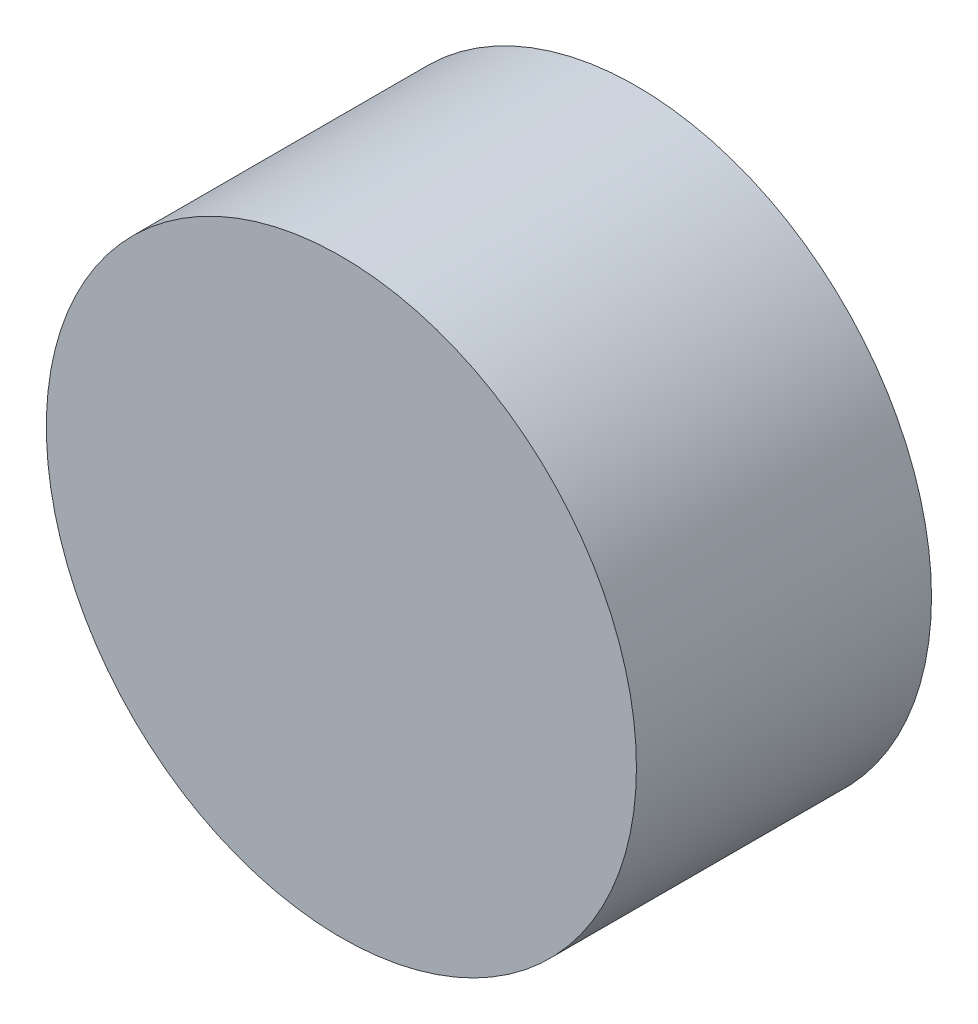
ISO-10303-21;
HEADER;
FILE_DESCRIPTION(('STEP AP214'),'2;1');
FILE_NAME('part.step','',(''),(''),'','','');
FILE_SCHEMA(('AUTOMOTIVE_DESIGN { 1 0 10303 214 1 1 1 1 }'));
ENDSEC;
DATA;
#1=APPLICATION_CONTEXT('core data for automotive mechanical design processes');
#2=APPLICATION_PROTOCOL_DEFINITION('international standard','automotive_design',2000,#1);
#3=PRODUCT_CONTEXT('',#1,'mechanical');
#4=PRODUCT('Part','Part','',(#3));
#5=PRODUCT_RELATED_PRODUCT_CATEGORY('part','',(#4));
#6=PRODUCT_DEFINITION_FORMATION('','',#4);
#7=PRODUCT_DEFINITION_CONTEXT('part definition',#1,'design');
#8=PRODUCT_DEFINITION('design','',#6,#7);
#9=PRODUCT_DEFINITION_SHAPE('','',#8);
#10=(LENGTH_UNIT() NAMED_UNIT(*) SI_UNIT(.MILLI.,.METRE.));
#11=(NAMED_UNIT(*) PLANE_ANGLE_UNIT() SI_UNIT($,.RADIAN.));
#12=(NAMED_UNIT(*) SI_UNIT($,.STERADIAN.) SOLID_ANGLE_UNIT());
#13=UNCERTAINTY_MEASURE_WITH_UNIT(LENGTH_MEASURE(1.E-05),#10,'distance_accuracy_value','');
#14=(GEOMETRIC_REPRESENTATION_CONTEXT(3) GLOBAL_UNCERTAINTY_ASSIGNED_CONTEXT((#13)) GLOBAL_UNIT_ASSIGNED_CONTEXT((#10,
#11,#12)) REPRESENTATION_CONTEXT('',''));
#15=CARTESIAN_POINT('',(0.,0.,0.));
#16=DIRECTION('',(0.,0.,1.));
#17=DIRECTION('',(1.,0.,0.));
#18=AXIS2_PLACEMENT_3D('',#15,#16,#17);
#19=CARTESIAN_POINT('',(0.,0.,101.6));
#20=DIRECTION('',(0.,0.,-1.));
#21=DIRECTION('',(-1.,0.,0.));
#22=AXIS2_PLACEMENT_3D('',#19,#20,#21);
#23=CYLINDRICAL_SURFACE('',#22,203.2);
#24=CARTESIAN_POINT('',(0.,0.,101.6));
#25=DIRECTION('',(0.,0.,1.));
#26=DIRECTION('',(1.,0.,0.));
#27=AXIS2_PLACEMENT_3D('',#24,#25,#26);
#28=CIRCLE('',#27,203.2);
#29=CARTESIAN_POINT('',(203.2,0.,101.6));
#30=VERTEX_POINT('',#29);
#31=EDGE_CURVE('E10',#30,#30,#28,.T.);
#32=ORIENTED_EDGE('',*,*,#31,.F.);
#33=EDGE_LOOP('',(#32));
#34=FACE_BOUND('',#33,.T.);
#35=CARTESIAN_POINT('',(0.,0.,-101.6));
#36=DIRECTION('',(0.,0.,1.));
#37=DIRECTION('',(1.,0.,0.));
#38=AXIS2_PLACEMENT_3D('',#35,#36,#37);
#39=CIRCLE('',#38,203.2);
#40=CARTESIAN_POINT('',(203.2,0.,-101.6));
#41=VERTEX_POINT('',#40);
#42=EDGE_CURVE('E34',#41,#41,#39,.T.);
#43=ORIENTED_EDGE('',*,*,#42,.T.);
#44=EDGE_LOOP('',(#43));
#45=FACE_BOUND('',#44,.T.);
#46=ADVANCED_FACE('F31',(#34,#45),#23,.T.);
#47=CARTESIAN_POINT('',(0.,0.,101.6));
#48=DIRECTION('',(0.,0.,1.));
#49=DIRECTION('',(1.,0.,0.));
#50=AXIS2_PLACEMENT_3D('',#47,#48,#49);
#51=PLANE('',#50);
#52=ORIENTED_EDGE('',*,*,#31,.T.);
#53=EDGE_LOOP('',(#52));
#54=FACE_BOUND('',#53,.T.);
#55=ADVANCED_FACE('F46',(#54),#51,.T.);
#56=CARTESIAN_POINT('',(0.,0.,-101.6));
#57=DIRECTION('',(0.,0.,1.));
#58=DIRECTION('',(1.,0.,0.));
#59=AXIS2_PLACEMENT_3D('',#56,#57,#58);
#60=PLANE('',#59);
#61=ORIENTED_EDGE('',*,*,#42,.F.);
#62=EDGE_LOOP('',(#61));
#63=FACE_BOUND('',#62,.T.);
#64=ADVANCED_FACE('F44',(#63),#60,.F.);
#65=CLOSED_SHELL('',(#46,#55,#64));
#66=MANIFOLD_SOLID_BREP('B2',#65);
#67=ADVANCED_BREP_SHAPE_REPRESENTATION('',(#18,#66),#14);
#68=SHAPE_DEFINITION_REPRESENTATION(#9,#67);
ENDSEC;
END-ISO-10303-21;
